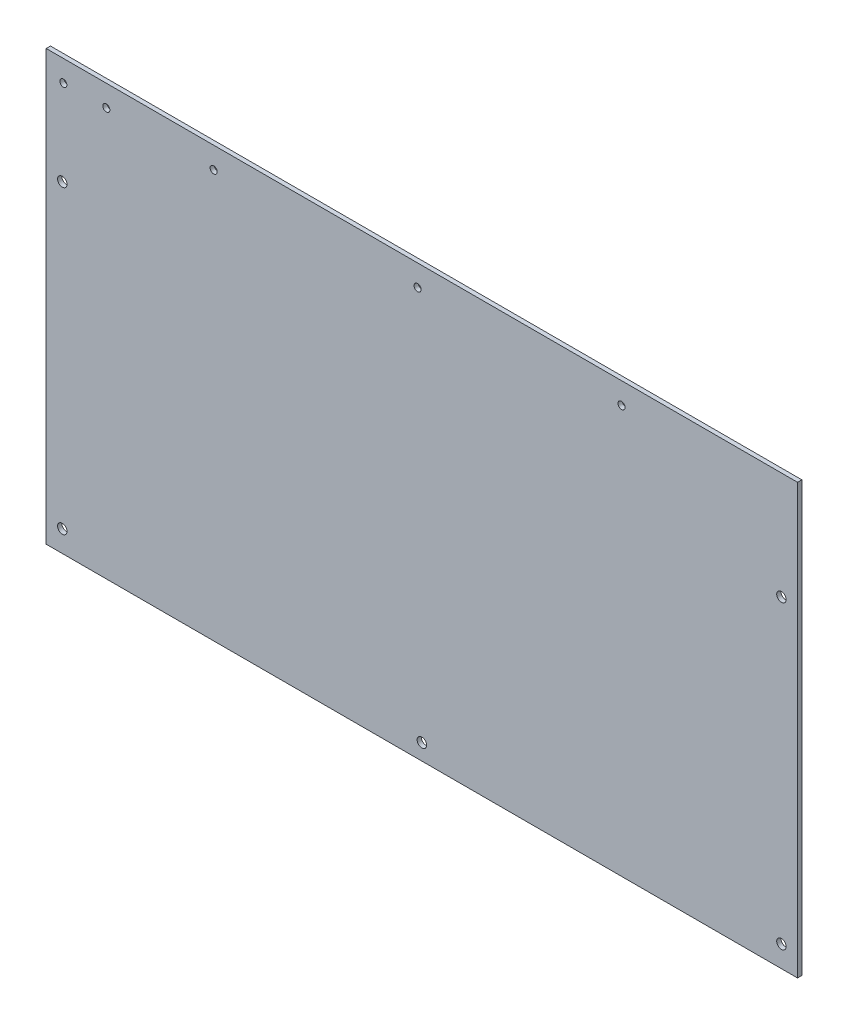
ISO-10303-21;
HEADER;
FILE_DESCRIPTION(('STEP AP214'),'2;1');
FILE_NAME('part.step','',(''),(''),'','','');
FILE_SCHEMA(('AUTOMOTIVE_DESIGN { 1 0 10303 214 1 1 1 1 }'));
ENDSEC;
DATA;
#1=APPLICATION_CONTEXT('core data for automotive mechanical design processes');
#2=APPLICATION_PROTOCOL_DEFINITION('international standard','automotive_design',2000,#1);
#3=PRODUCT_CONTEXT('',#1,'mechanical');
#4=PRODUCT('Part','Part','',(#3));
#5=PRODUCT_RELATED_PRODUCT_CATEGORY('part','',(#4));
#6=PRODUCT_DEFINITION_FORMATION('','',#4);
#7=PRODUCT_DEFINITION_CONTEXT('part definition',#1,'design');
#8=PRODUCT_DEFINITION('design','',#6,#7);
#9=PRODUCT_DEFINITION_SHAPE('','',#8);
#10=(LENGTH_UNIT() NAMED_UNIT(*) SI_UNIT(.MILLI.,.METRE.));
#11=(NAMED_UNIT(*) PLANE_ANGLE_UNIT() SI_UNIT($,.RADIAN.));
#12=(NAMED_UNIT(*) SI_UNIT($,.STERADIAN.) SOLID_ANGLE_UNIT());
#13=UNCERTAINTY_MEASURE_WITH_UNIT(LENGTH_MEASURE(1.E-05),#10,'distance_accuracy_value','');
#14=(GEOMETRIC_REPRESENTATION_CONTEXT(3) GLOBAL_UNCERTAINTY_ASSIGNED_CONTEXT((#13)) GLOBAL_UNIT_ASSIGNED_CONTEXT((#10,
#11,#12)) REPRESENTATION_CONTEXT('',''));
#15=CARTESIAN_POINT('',(0.,0.,0.));
#16=DIRECTION('',(0.,0.,1.));
#17=DIRECTION('',(1.,0.,0.));
#18=AXIS2_PLACEMENT_3D('',#15,#16,#17);
#19=CARTESIAN_POINT('',(175.,100.,2.));
#20=DIRECTION('',(-1.,0.,0.));
#21=DIRECTION('',(0.,-1.,0.));
#22=AXIS2_PLACEMENT_3D('',#19,#20,#21);
#23=PLANE('',#22);
#24=DIRECTION('',(0.,1.,0.));
#25=VECTOR('',#24,1.);
#26=CARTESIAN_POINT('',(175.,100.,0.));
#27=LINE('',#26,#25);
#28=CARTESIAN_POINT('',(175.,-100.,0.));
#29=VERTEX_POINT('',#28);
#30=CARTESIAN_POINT('',(175.,100.,0.));
#31=VERTEX_POINT('',#30);
#32=EDGE_CURVE('E109',#29,#31,#27,.T.);
#33=ORIENTED_EDGE('',*,*,#32,.T.);
#34=DIRECTION('',(0.,0.,-1.));
#35=VECTOR('',#34,1.);
#36=CARTESIAN_POINT('',(175.,100.,2.));
#37=LINE('',#36,#35);
#38=CARTESIAN_POINT('',(175.,100.,2.));
#39=VERTEX_POINT('',#38);
#40=EDGE_CURVE('E12',#39,#31,#37,.T.);
#41=ORIENTED_EDGE('',*,*,#40,.F.);
#42=DIRECTION('',(0.,1.,0.));
#43=VECTOR('',#42,1.);
#44=CARTESIAN_POINT('',(175.,100.,2.));
#45=LINE('',#44,#43);
#46=CARTESIAN_POINT('',(175.,-100.,2.));
#47=VERTEX_POINT('',#46);
#48=EDGE_CURVE('E96',#47,#39,#45,.T.);
#49=ORIENTED_EDGE('',*,*,#48,.F.);
#50=DIRECTION('',(0.,0.,-1.));
#51=VECTOR('',#50,1.);
#52=CARTESIAN_POINT('',(175.,-100.,2.));
#53=LINE('',#52,#51);
#54=EDGE_CURVE('E105',#47,#29,#53,.T.);
#55=ORIENTED_EDGE('',*,*,#54,.T.);
#56=EDGE_LOOP('',(#33,#41,#49,#55));
#57=FACE_BOUND('',#56,.T.);
#58=ADVANCED_FACE('F43',(#57),#23,.F.);
#59=CARTESIAN_POINT('',(-175.,100.,2.));
#60=DIRECTION('',(0.,-1.,0.));
#61=DIRECTION('',(0.,0.,-1.));
#62=AXIS2_PLACEMENT_3D('',#59,#60,#61);
#63=PLANE('',#62);
#64=DIRECTION('',(-1.,0.,0.));
#65=VECTOR('',#64,1.);
#66=CARTESIAN_POINT('',(-175.,100.,0.));
#67=LINE('',#66,#65);
#68=CARTESIAN_POINT('',(-175.,100.,0.));
#69=VERTEX_POINT('',#68);
#70=EDGE_CURVE('E100',#31,#69,#67,.T.);
#71=ORIENTED_EDGE('',*,*,#70,.T.);
#72=DIRECTION('',(0.,0.,-1.));
#73=VECTOR('',#72,1.);
#74=CARTESIAN_POINT('',(-175.,100.,2.));
#75=LINE('',#74,#73);
#76=CARTESIAN_POINT('',(-175.,100.,2.));
#77=VERTEX_POINT('',#76);
#78=EDGE_CURVE('E52',#77,#69,#75,.T.);
#79=ORIENTED_EDGE('',*,*,#78,.F.);
#80=DIRECTION('',(-1.,0.,0.));
#81=VECTOR('',#80,1.);
#82=CARTESIAN_POINT('',(-175.,100.,2.));
#83=LINE('',#82,#81);
#84=EDGE_CURVE('E91',#39,#77,#83,.T.);
#85=ORIENTED_EDGE('',*,*,#84,.F.);
#86=ORIENTED_EDGE('',*,*,#40,.T.);
#87=EDGE_LOOP('',(#71,#79,#85,#86));
#88=FACE_BOUND('',#87,.T.);
#89=ADVANCED_FACE('F99',(#88),#63,.F.);
#90=CARTESIAN_POINT('',(-175.,100.,2.));
#91=DIRECTION('',(1.,0.,0.));
#92=DIRECTION('',(0.,1.,0.));
#93=AXIS2_PLACEMENT_3D('',#90,#91,#92);
#94=PLANE('',#93);
#95=DIRECTION('',(0.,-1.,0.));
#96=VECTOR('',#95,1.);
#97=CARTESIAN_POINT('',(-175.,100.,0.));
#98=LINE('',#97,#96);
#99=CARTESIAN_POINT('',(-175.,-100.,0.));
#100=VERTEX_POINT('',#99);
#101=EDGE_CURVE('E78',#69,#100,#98,.T.);
#102=ORIENTED_EDGE('',*,*,#101,.T.);
#103=DIRECTION('',(0.,0.,-1.));
#104=VECTOR('',#103,1.);
#105=CARTESIAN_POINT('',(-175.,-100.,2.));
#106=LINE('',#105,#104);
#107=CARTESIAN_POINT('',(-175.,-100.,2.));
#108=VERTEX_POINT('',#107);
#109=EDGE_CURVE('E101',#108,#100,#106,.T.);
#110=ORIENTED_EDGE('',*,*,#109,.F.);
#111=DIRECTION('',(0.,-1.,0.));
#112=VECTOR('',#111,1.);
#113=CARTESIAN_POINT('',(-175.,100.,2.));
#114=LINE('',#113,#112);
#115=EDGE_CURVE('E94',#77,#108,#114,.T.);
#116=ORIENTED_EDGE('',*,*,#115,.F.);
#117=ORIENTED_EDGE('',*,*,#78,.T.);
#118=EDGE_LOOP('',(#102,#110,#116,#117));
#119=FACE_BOUND('',#118,.T.);
#120=ADVANCED_FACE('F103',(#119),#94,.F.);
#121=CARTESIAN_POINT('',(-175.,-100.,2.));
#122=DIRECTION('',(0.,1.,0.));
#123=DIRECTION('',(0.,0.,1.));
#124=AXIS2_PLACEMENT_3D('',#121,#122,#123);
#125=PLANE('',#124);
#126=DIRECTION('',(1.,0.,0.));
#127=VECTOR('',#126,1.);
#128=CARTESIAN_POINT('',(-175.,-100.,0.));
#129=LINE('',#128,#127);
#130=EDGE_CURVE('E84',#100,#29,#129,.T.);
#131=ORIENTED_EDGE('',*,*,#130,.T.);
#132=ORIENTED_EDGE('',*,*,#54,.F.);
#133=DIRECTION('',(1.,0.,0.));
#134=VECTOR('',#133,1.);
#135=CARTESIAN_POINT('',(-175.,-100.,2.));
#136=LINE('',#135,#134);
#137=EDGE_CURVE('E61',#108,#47,#136,.T.);
#138=ORIENTED_EDGE('',*,*,#137,.F.);
#139=ORIENTED_EDGE('',*,*,#109,.T.);
#140=EDGE_LOOP('',(#131,#132,#138,#139));
#141=FACE_BOUND('',#140,.T.);
#142=ADVANCED_FACE('F168',(#141),#125,.F.);
#143=CARTESIAN_POINT('',(0.,0.,2.));
#144=DIRECTION('',(0.,0.,1.));
#145=DIRECTION('',(1.,0.,0.));
#146=AXIS2_PLACEMENT_3D('',#143,#144,#145);
#147=PLANE('',#146);
#148=CARTESIAN_POINT('',(-147.,90.0266665348183,2.));
#149=DIRECTION('',(0.,0.,1.));
#150=DIRECTION('',(1.,0.,0.));
#151=AXIS2_PLACEMENT_3D('',#148,#149,#150);
#152=CIRCLE('',#151,1.64999999999998);
#153=CARTESIAN_POINT('',(-145.35,90.0266665348183,2.));
#154=VERTEX_POINT('',#153);
#155=EDGE_CURVE('E346',#154,#154,#152,.T.);
#156=ORIENTED_EDGE('',*,*,#155,.F.);
#157=EDGE_LOOP('',(#156));
#158=FACE_BOUND('',#157,.T.);
#159=CARTESIAN_POINT('',(-167.,90.0266665348183,2.));
#160=DIRECTION('',(0.,0.,1.));
#161=DIRECTION('',(1.,0.,0.));
#162=AXIS2_PLACEMENT_3D('',#159,#160,#161);
#163=CIRCLE('',#162,1.64999999999998);
#164=CARTESIAN_POINT('',(-165.35,90.0266665348183,2.));
#165=VERTEX_POINT('',#164);
#166=EDGE_CURVE('E341',#165,#165,#163,.T.);
#167=ORIENTED_EDGE('',*,*,#166,.F.);
#168=EDGE_LOOP('',(#167));
#169=FACE_BOUND('',#168,.T.);
#170=CARTESIAN_POINT('',(93.,90.0266665348183,2.));
#171=DIRECTION('',(0.,0.,1.));
#172=DIRECTION('',(1.,0.,0.));
#173=AXIS2_PLACEMENT_3D('',#170,#171,#172);
#174=CIRCLE('',#173,1.64999999999998);
#175=CARTESIAN_POINT('',(94.65,90.0266665348183,2.));
#176=VERTEX_POINT('',#175);
#177=EDGE_CURVE('E335',#176,#176,#174,.T.);
#178=ORIENTED_EDGE('',*,*,#177,.F.);
#179=EDGE_LOOP('',(#178));
#180=FACE_BOUND('',#179,.T.);
#181=CARTESIAN_POINT('',(-1.99999999999999,90.0266665348183,2.));
#182=DIRECTION('',(0.,0.,1.));
#183=DIRECTION('',(1.,0.,0.));
#184=AXIS2_PLACEMENT_3D('',#181,#182,#183);
#185=CIRCLE('',#184,1.64999999999999);
#186=CARTESIAN_POINT('',(-0.35,90.0266665348183,2.));
#187=VERTEX_POINT('',#186);
#188=EDGE_CURVE('E329',#187,#187,#185,.T.);
#189=ORIENTED_EDGE('',*,*,#188,.F.);
#190=EDGE_LOOP('',(#189));
#191=FACE_BOUND('',#190,.T.);
#192=CARTESIAN_POINT('',(-97.,90.0266665348183,2.));
#193=DIRECTION('',(0.,0.,1.));
#194=DIRECTION('',(1.,0.,0.));
#195=AXIS2_PLACEMENT_3D('',#192,#193,#194);
#196=CIRCLE('',#195,1.64999999999998);
#197=CARTESIAN_POINT('',(-95.35,90.0266665348183,2.));
#198=VERTEX_POINT('',#197);
#199=EDGE_CURVE('E323',#198,#198,#196,.T.);
#200=ORIENTED_EDGE('',*,*,#199,.F.);
#201=EDGE_LOOP('',(#200));
#202=FACE_BOUND('',#201,.T.);
#203=CARTESIAN_POINT('',(0.,-92.5,2.));
#204=DIRECTION('',(0.,0.,1.));
#205=DIRECTION('',(1.,0.,0.));
#206=AXIS2_PLACEMENT_3D('',#203,#204,#205);
#207=CIRCLE('',#206,2.2);
#208=CARTESIAN_POINT('',(2.19999999999997,-92.5,2.));
#209=VERTEX_POINT('',#208);
#210=EDGE_CURVE('E305',#209,#209,#207,.T.);
#211=ORIENTED_EDGE('',*,*,#210,.F.);
#212=EDGE_LOOP('',(#211));
#213=FACE_BOUND('',#212,.T.);
#214=CARTESIAN_POINT('',(167.5,50.,2.));
#215=DIRECTION('',(0.,0.,1.));
#216=DIRECTION('',(1.,0.,0.));
#217=AXIS2_PLACEMENT_3D('',#214,#215,#216);
#218=CIRCLE('',#217,2.20000000000001);
#219=CARTESIAN_POINT('',(169.7,50.,2.));
#220=VERTEX_POINT('',#219);
#221=EDGE_CURVE('E302',#220,#220,#218,.T.);
#222=ORIENTED_EDGE('',*,*,#221,.F.);
#223=EDGE_LOOP('',(#222));
#224=FACE_BOUND('',#223,.T.);
#225=CARTESIAN_POINT('',(-167.5,-90.,2.));
#226=DIRECTION('',(0.,0.,1.));
#227=DIRECTION('',(1.,0.,0.));
#228=AXIS2_PLACEMENT_3D('',#225,#226,#227);
#229=CIRCLE('',#228,2.20000000000001);
#230=CARTESIAN_POINT('',(-165.3,-90.,2.));
#231=VERTEX_POINT('',#230);
#232=EDGE_CURVE('E299',#231,#231,#229,.T.);
#233=ORIENTED_EDGE('',*,*,#232,.F.);
#234=EDGE_LOOP('',(#233));
#235=FACE_BOUND('',#234,.T.);
#236=CARTESIAN_POINT('',(167.5,-90.,2.));
#237=DIRECTION('',(0.,0.,1.));
#238=DIRECTION('',(1.,0.,0.));
#239=AXIS2_PLACEMENT_3D('',#236,#237,#238);
#240=CIRCLE('',#239,2.20000000000001);
#241=CARTESIAN_POINT('',(169.7,-90.,2.));
#242=VERTEX_POINT('',#241);
#243=EDGE_CURVE('E292',#242,#242,#240,.T.);
#244=ORIENTED_EDGE('',*,*,#243,.F.);
#245=EDGE_LOOP('',(#244));
#246=FACE_BOUND('',#245,.T.);
#247=CARTESIAN_POINT('',(-167.5,50.,2.));
#248=DIRECTION('',(0.,0.,1.));
#249=DIRECTION('',(1.,0.,0.));
#250=AXIS2_PLACEMENT_3D('',#247,#248,#249);
#251=CIRCLE('',#250,2.20000000000001);
#252=CARTESIAN_POINT('',(-165.3,50.,2.));
#253=VERTEX_POINT('',#252);
#254=EDGE_CURVE('E122',#253,#253,#251,.T.);
#255=ORIENTED_EDGE('',*,*,#254,.F.);
#256=EDGE_LOOP('',(#255));
#257=FACE_BOUND('',#256,.T.);
#258=ORIENTED_EDGE('',*,*,#48,.T.);
#259=ORIENTED_EDGE('',*,*,#84,.T.);
#260=ORIENTED_EDGE('',*,*,#115,.T.);
#261=ORIENTED_EDGE('',*,*,#137,.T.);
#262=EDGE_LOOP('',(#258,#259,#260,#261));
#263=FACE_BOUND('',#262,.T.);
#264=ADVANCED_FACE('F92',(#158,#169,#180,#191,#202,#213,#224,#235,#246,#257,#263),#147,.T.);
#265=CARTESIAN_POINT('',(0.,0.,0.));
#266=DIRECTION('',(0.,0.,1.));
#267=DIRECTION('',(1.,0.,0.));
#268=AXIS2_PLACEMENT_3D('',#265,#266,#267);
#269=PLANE('',#268);
#270=CARTESIAN_POINT('',(-147.,90.0266665348183,0.));
#271=DIRECTION('',(0.,0.,1.));
#272=DIRECTION('',(1.,0.,0.));
#273=AXIS2_PLACEMENT_3D('',#270,#271,#272);
#274=CIRCLE('',#273,1.64999999999998);
#275=CARTESIAN_POINT('',(-145.35,90.0266665348183,0.));
#276=VERTEX_POINT('',#275);
#277=EDGE_CURVE('E344',#276,#276,#274,.T.);
#278=ORIENTED_EDGE('',*,*,#277,.T.);
#279=EDGE_LOOP('',(#278));
#280=FACE_BOUND('',#279,.T.);
#281=CARTESIAN_POINT('',(-167.,90.0266665348183,0.));
#282=DIRECTION('',(0.,0.,1.));
#283=DIRECTION('',(1.,0.,0.));
#284=AXIS2_PLACEMENT_3D('',#281,#282,#283);
#285=CIRCLE('',#284,1.64999999999998);
#286=CARTESIAN_POINT('',(-165.35,90.0266665348183,0.));
#287=VERTEX_POINT('',#286);
#288=EDGE_CURVE('E338',#287,#287,#285,.T.);
#289=ORIENTED_EDGE('',*,*,#288,.T.);
#290=EDGE_LOOP('',(#289));
#291=FACE_BOUND('',#290,.T.);
#292=CARTESIAN_POINT('',(93.,90.0266665348183,0.));
#293=DIRECTION('',(0.,0.,1.));
#294=DIRECTION('',(1.,0.,0.));
#295=AXIS2_PLACEMENT_3D('',#292,#293,#294);
#296=CIRCLE('',#295,1.65);
#297=CARTESIAN_POINT('',(94.65,90.0266665348183,0.));
#298=VERTEX_POINT('',#297);
#299=EDGE_CURVE('E332',#298,#298,#296,.T.);
#300=ORIENTED_EDGE('',*,*,#299,.T.);
#301=EDGE_LOOP('',(#300));
#302=FACE_BOUND('',#301,.T.);
#303=CARTESIAN_POINT('',(-1.99999999999999,90.0266665348183,0.));
#304=DIRECTION('',(0.,0.,1.));
#305=DIRECTION('',(1.,0.,0.));
#306=AXIS2_PLACEMENT_3D('',#303,#304,#305);
#307=CIRCLE('',#306,1.65);
#308=CARTESIAN_POINT('',(-0.34999999999999,90.0266665348183,0.));
#309=VERTEX_POINT('',#308);
#310=EDGE_CURVE('E326',#309,#309,#307,.T.);
#311=ORIENTED_EDGE('',*,*,#310,.T.);
#312=EDGE_LOOP('',(#311));
#313=FACE_BOUND('',#312,.T.);
#314=CARTESIAN_POINT('',(-97.,90.0266665348183,0.));
#315=DIRECTION('',(0.,0.,1.));
#316=DIRECTION('',(1.,0.,0.));
#317=AXIS2_PLACEMENT_3D('',#314,#315,#316);
#318=CIRCLE('',#317,1.65);
#319=CARTESIAN_POINT('',(-95.35,90.0266665348183,0.));
#320=VERTEX_POINT('',#319);
#321=EDGE_CURVE('E320',#320,#320,#318,.T.);
#322=ORIENTED_EDGE('',*,*,#321,.T.);
#323=EDGE_LOOP('',(#322));
#324=FACE_BOUND('',#323,.T.);
#325=CARTESIAN_POINT('',(0.,-92.5,0.));
#326=DIRECTION('',(0.,0.,1.));
#327=DIRECTION('',(1.,0.,0.));
#328=AXIS2_PLACEMENT_3D('',#325,#326,#327);
#329=CIRCLE('',#328,2.2);
#330=CARTESIAN_POINT('',(2.19999999999997,-92.5,0.));
#331=VERTEX_POINT('',#330);
#332=EDGE_CURVE('E46',#331,#331,#329,.T.);
#333=ORIENTED_EDGE('',*,*,#332,.T.);
#334=EDGE_LOOP('',(#333));
#335=FACE_BOUND('',#334,.T.);
#336=CARTESIAN_POINT('',(167.5,50.,0.));
#337=DIRECTION('',(0.,0.,1.));
#338=DIRECTION('',(1.,0.,0.));
#339=AXIS2_PLACEMENT_3D('',#336,#337,#338);
#340=CIRCLE('',#339,2.20000000000001);
#341=CARTESIAN_POINT('',(169.7,50.,0.));
#342=VERTEX_POINT('',#341);
#343=EDGE_CURVE('E112',#342,#342,#340,.T.);
#344=ORIENTED_EDGE('',*,*,#343,.T.);
#345=EDGE_LOOP('',(#344));
#346=FACE_BOUND('',#345,.T.);
#347=CARTESIAN_POINT('',(-167.5,-90.,0.));
#348=DIRECTION('',(0.,0.,1.));
#349=DIRECTION('',(1.,0.,0.));
#350=AXIS2_PLACEMENT_3D('',#347,#348,#349);
#351=CIRCLE('',#350,2.20000000000001);
#352=CARTESIAN_POINT('',(-165.3,-90.,0.));
#353=VERTEX_POINT('',#352);
#354=EDGE_CURVE('E125',#353,#353,#351,.T.);
#355=ORIENTED_EDGE('',*,*,#354,.T.);
#356=EDGE_LOOP('',(#355));
#357=FACE_BOUND('',#356,.T.);
#358=CARTESIAN_POINT('',(167.5,-90.,0.));
#359=DIRECTION('',(0.,0.,1.));
#360=DIRECTION('',(1.,0.,0.));
#361=AXIS2_PLACEMENT_3D('',#358,#359,#360);
#362=CIRCLE('',#361,2.20000000000001);
#363=CARTESIAN_POINT('',(169.7,-90.,0.));
#364=VERTEX_POINT('',#363);
#365=EDGE_CURVE('E121',#364,#364,#362,.T.);
#366=ORIENTED_EDGE('',*,*,#365,.T.);
#367=EDGE_LOOP('',(#366));
#368=FACE_BOUND('',#367,.T.);
#369=CARTESIAN_POINT('',(-167.5,50.,0.));
#370=DIRECTION('',(0.,0.,1.));
#371=DIRECTION('',(1.,0.,0.));
#372=AXIS2_PLACEMENT_3D('',#369,#370,#371);
#373=CIRCLE('',#372,2.20000000000001);
#374=CARTESIAN_POINT('',(-165.3,50.,0.));
#375=VERTEX_POINT('',#374);
#376=EDGE_CURVE('E118',#375,#375,#373,.T.);
#377=ORIENTED_EDGE('',*,*,#376,.T.);
#378=EDGE_LOOP('',(#377));
#379=FACE_BOUND('',#378,.T.);
#380=ORIENTED_EDGE('',*,*,#32,.F.);
#381=ORIENTED_EDGE('',*,*,#130,.F.);
#382=ORIENTED_EDGE('',*,*,#101,.F.);
#383=ORIENTED_EDGE('',*,*,#70,.F.);
#384=EDGE_LOOP('',(#380,#381,#382,#383));
#385=FACE_BOUND('',#384,.T.);
#386=ADVANCED_FACE('F130',(#280,#291,#302,#313,#324,#335,#346,#357,#368,#379,#385),#269,.F.);
#387=CARTESIAN_POINT('',(-167.5,50.,-158.));
#388=DIRECTION('',(0.,0.,1.));
#389=DIRECTION('',(1.,0.,0.));
#390=AXIS2_PLACEMENT_3D('',#387,#388,#389);
#391=CYLINDRICAL_SURFACE('',#390,2.20000000000001);
#392=ORIENTED_EDGE('',*,*,#254,.T.);
#393=EDGE_LOOP('',(#392));
#394=FACE_BOUND('',#393,.T.);
#395=ORIENTED_EDGE('',*,*,#376,.F.);
#396=EDGE_LOOP('',(#395));
#397=FACE_BOUND('',#396,.T.);
#398=ADVANCED_FACE('F159',(#394,#397),#391,.F.);
#399=CARTESIAN_POINT('',(167.5,-90.,-158.));
#400=DIRECTION('',(0.,0.,1.));
#401=DIRECTION('',(1.,0.,0.));
#402=AXIS2_PLACEMENT_3D('',#399,#400,#401);
#403=CYLINDRICAL_SURFACE('',#402,2.20000000000001);
#404=ORIENTED_EDGE('',*,*,#243,.T.);
#405=EDGE_LOOP('',(#404));
#406=FACE_BOUND('',#405,.T.);
#407=ORIENTED_EDGE('',*,*,#365,.F.);
#408=EDGE_LOOP('',(#407));
#409=FACE_BOUND('',#408,.T.);
#410=ADVANCED_FACE('F146',(#406,#409),#403,.F.);
#411=CARTESIAN_POINT('',(-167.5,-90.,-158.));
#412=DIRECTION('',(0.,0.,1.));
#413=DIRECTION('',(1.,0.,0.));
#414=AXIS2_PLACEMENT_3D('',#411,#412,#413);
#415=CYLINDRICAL_SURFACE('',#414,2.20000000000001);
#416=ORIENTED_EDGE('',*,*,#232,.T.);
#417=EDGE_LOOP('',(#416));
#418=FACE_BOUND('',#417,.T.);
#419=ORIENTED_EDGE('',*,*,#354,.F.);
#420=EDGE_LOOP('',(#419));
#421=FACE_BOUND('',#420,.T.);
#422=ADVANCED_FACE('F136',(#418,#421),#415,.F.);
#423=CARTESIAN_POINT('',(167.5,50.,-158.));
#424=DIRECTION('',(0.,0.,1.));
#425=DIRECTION('',(1.,0.,0.));
#426=AXIS2_PLACEMENT_3D('',#423,#424,#425);
#427=CYLINDRICAL_SURFACE('',#426,2.20000000000001);
#428=ORIENTED_EDGE('',*,*,#221,.T.);
#429=EDGE_LOOP('',(#428));
#430=FACE_BOUND('',#429,.T.);
#431=ORIENTED_EDGE('',*,*,#343,.F.);
#432=EDGE_LOOP('',(#431));
#433=FACE_BOUND('',#432,.T.);
#434=ADVANCED_FACE('F133',(#430,#433),#427,.F.);
#435=CARTESIAN_POINT('',(0.,-92.5,-158.));
#436=DIRECTION('',(0.,0.,1.));
#437=DIRECTION('',(1.,0.,0.));
#438=AXIS2_PLACEMENT_3D('',#435,#436,#437);
#439=CYLINDRICAL_SURFACE('',#438,2.2);
#440=ORIENTED_EDGE('',*,*,#210,.T.);
#441=EDGE_LOOP('',(#440));
#442=FACE_BOUND('',#441,.T.);
#443=ORIENTED_EDGE('',*,*,#332,.F.);
#444=EDGE_LOOP('',(#443));
#445=FACE_BOUND('',#444,.T.);
#446=ADVANCED_FACE('F135',(#442,#445),#439,.F.);
#447=CARTESIAN_POINT('',(-97.,90.0266665348183,2.));
#448=DIRECTION('',(0.,0.,1.));
#449=DIRECTION('',(1.,0.,0.));
#450=AXIS2_PLACEMENT_3D('',#447,#448,#449);
#451=CYLINDRICAL_SURFACE('',#450,1.64999999999999);
#452=ORIENTED_EDGE('',*,*,#321,.F.);
#453=EDGE_LOOP('',(#452));
#454=FACE_BOUND('',#453,.T.);
#455=ORIENTED_EDGE('',*,*,#199,.T.);
#456=EDGE_LOOP('',(#455));
#457=FACE_BOUND('',#456,.T.);
#458=ADVANCED_FACE('F143',(#454,#457),#451,.F.);
#459=CARTESIAN_POINT('',(-1.99999999999999,90.0266665348183,2.));
#460=DIRECTION('',(0.,0.,1.));
#461=DIRECTION('',(1.,0.,0.));
#462=AXIS2_PLACEMENT_3D('',#459,#460,#461);
#463=CYLINDRICAL_SURFACE('',#462,1.64999999999999);
#464=ORIENTED_EDGE('',*,*,#310,.F.);
#465=EDGE_LOOP('',(#464));
#466=FACE_BOUND('',#465,.T.);
#467=ORIENTED_EDGE('',*,*,#188,.T.);
#468=EDGE_LOOP('',(#467));
#469=FACE_BOUND('',#468,.T.);
#470=ADVANCED_FACE('F232',(#466,#469),#463,.F.);
#471=CARTESIAN_POINT('',(93.,90.0266665348183,2.));
#472=DIRECTION('',(0.,0.,1.));
#473=DIRECTION('',(1.,0.,0.));
#474=AXIS2_PLACEMENT_3D('',#471,#472,#473);
#475=CYLINDRICAL_SURFACE('',#474,1.64999999999999);
#476=ORIENTED_EDGE('',*,*,#299,.F.);
#477=EDGE_LOOP('',(#476));
#478=FACE_BOUND('',#477,.T.);
#479=ORIENTED_EDGE('',*,*,#177,.T.);
#480=EDGE_LOOP('',(#479));
#481=FACE_BOUND('',#480,.T.);
#482=ADVANCED_FACE('F196',(#478,#481),#475,.F.);
#483=CARTESIAN_POINT('',(-167.,90.0266665348183,2.));
#484=DIRECTION('',(0.,0.,1.));
#485=DIRECTION('',(1.,0.,0.));
#486=AXIS2_PLACEMENT_3D('',#483,#484,#485);
#487=CYLINDRICAL_SURFACE('',#486,1.64999999999998);
#488=ORIENTED_EDGE('',*,*,#288,.F.);
#489=EDGE_LOOP('',(#488));
#490=FACE_BOUND('',#489,.T.);
#491=ORIENTED_EDGE('',*,*,#166,.T.);
#492=EDGE_LOOP('',(#491));
#493=FACE_BOUND('',#492,.T.);
#494=ADVANCED_FACE('F206',(#490,#493),#487,.F.);
#495=CARTESIAN_POINT('',(-147.,90.0266665348183,2.));
#496=DIRECTION('',(0.,0.,1.));
#497=DIRECTION('',(1.,0.,0.));
#498=AXIS2_PLACEMENT_3D('',#495,#496,#497);
#499=CYLINDRICAL_SURFACE('',#498,1.64999999999998);
#500=ORIENTED_EDGE('',*,*,#277,.F.);
#501=EDGE_LOOP('',(#500));
#502=FACE_BOUND('',#501,.T.);
#503=ORIENTED_EDGE('',*,*,#155,.T.);
#504=EDGE_LOOP('',(#503));
#505=FACE_BOUND('',#504,.T.);
#506=ADVANCED_FACE('F212',(#502,#505),#499,.F.);
#507=CLOSED_SHELL('',(#58,#89,#120,#142,#264,#386,#398,#410,#422,#434,#446,#458,#470,#482,#494,#506));
#508=MANIFOLD_SOLID_BREP('B2',#507);
#509=ADVANCED_BREP_SHAPE_REPRESENTATION('',(#18,#508),#14);
#510=SHAPE_DEFINITION_REPRESENTATION(#9,#509);
ENDSEC;
END-ISO-10303-21;
